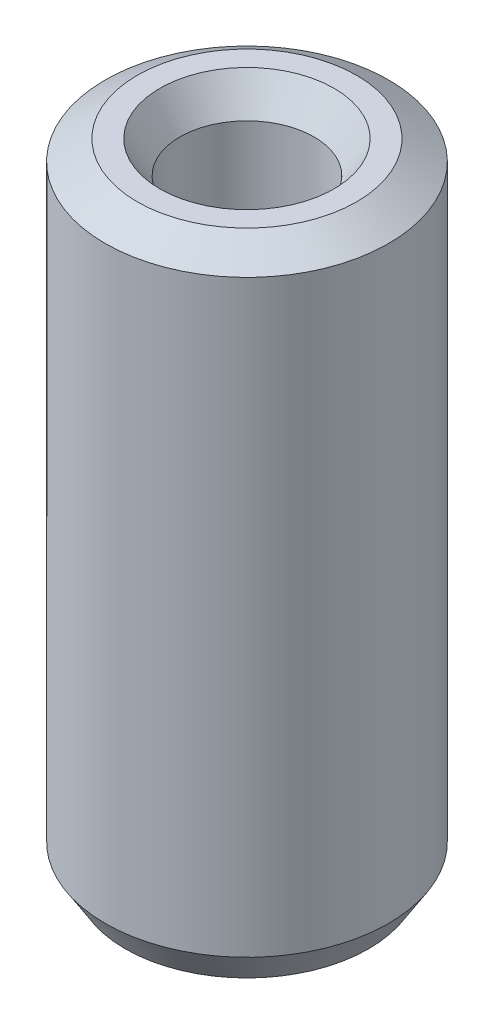
ISO-10303-21;
HEADER;
FILE_DESCRIPTION(('STEP AP214'),'2;1');
FILE_NAME('part.step','',(''),(''),'','','');
FILE_SCHEMA(('AUTOMOTIVE_DESIGN { 1 0 10303 214 1 1 1 1 }'));
ENDSEC;
DATA;
#1=APPLICATION_CONTEXT('core data for automotive mechanical design processes');
#2=APPLICATION_PROTOCOL_DEFINITION('international standard','automotive_design',2000,#1);
#3=PRODUCT_CONTEXT('',#1,'mechanical');
#4=PRODUCT('Part','Part','',(#3));
#5=PRODUCT_RELATED_PRODUCT_CATEGORY('part','',(#4));
#6=PRODUCT_DEFINITION_FORMATION('','',#4);
#7=PRODUCT_DEFINITION_CONTEXT('part definition',#1,'design');
#8=PRODUCT_DEFINITION('design','',#6,#7);
#9=PRODUCT_DEFINITION_SHAPE('','',#8);
#10=(LENGTH_UNIT() NAMED_UNIT(*) SI_UNIT(.MILLI.,.METRE.));
#11=(NAMED_UNIT(*) PLANE_ANGLE_UNIT() SI_UNIT($,.RADIAN.));
#12=(NAMED_UNIT(*) SI_UNIT($,.STERADIAN.) SOLID_ANGLE_UNIT());
#13=UNCERTAINTY_MEASURE_WITH_UNIT(LENGTH_MEASURE(1.E-05),#10,'distance_accuracy_value','');
#14=(GEOMETRIC_REPRESENTATION_CONTEXT(3) GLOBAL_UNCERTAINTY_ASSIGNED_CONTEXT((#13)) GLOBAL_UNIT_ASSIGNED_CONTEXT((#10,
#11,#12)) REPRESENTATION_CONTEXT('',''));
#15=CARTESIAN_POINT('',(0.,0.,0.));
#16=DIRECTION('',(0.,0.,1.));
#17=DIRECTION('',(1.,0.,0.));
#18=AXIS2_PLACEMENT_3D('',#15,#16,#17);
#19=CARTESIAN_POINT('',(0.,33.9199743696865,0.));
#20=DIRECTION('',(0.,-1.,0.));
#21=DIRECTION('',(0.,0.,-1.));
#22=AXIS2_PLACEMENT_3D('',#19,#20,#21);
#23=CYLINDRICAL_SURFACE('',#22,7.5);
#24=CARTESIAN_POINT('',(0.,1.69656926600727,0.));
#25=DIRECTION('',(0.,1.,0.));
#26=DIRECTION('',(0.,0.,1.));
#27=AXIS2_PLACEMENT_3D('',#24,#25,#26);
#28=CIRCLE('',#27,7.5);
#29=CARTESIAN_POINT('',(0.,1.69656926600727,7.5));
#30=VERTEX_POINT('',#29);
#31=EDGE_CURVE('E10',#30,#30,#28,.T.);
#32=ORIENTED_EDGE('',*,*,#31,.T.);
#33=EDGE_LOOP('',(#32));
#34=FACE_BOUND('',#33,.T.);
#35=CARTESIAN_POINT('',(0.,32.8597413938657,0.));
#36=DIRECTION('',(0.,1.,0.));
#37=DIRECTION('',(0.,0.,1.));
#38=AXIS2_PLACEMENT_3D('',#35,#36,#37);
#39=CIRCLE('',#38,7.5);
#40=CARTESIAN_POINT('',(0.,32.8597413938657,7.5));
#41=VERTEX_POINT('',#40);
#42=EDGE_CURVE('E50',#41,#41,#39,.F.);
#43=ORIENTED_EDGE('',*,*,#42,.T.);
#44=EDGE_LOOP('',(#43));
#45=FACE_BOUND('',#44,.T.);
#46=ADVANCED_FACE('F39',(#34,#45),#23,.T.);
#47=CARTESIAN_POINT('',(0.,33.9199743696865,0.));
#48=DIRECTION('',(0.,1.,0.));
#49=DIRECTION('',(0.,0.,1.));
#50=AXIS2_PLACEMENT_3D('',#47,#48,#49);
#51=PLANE('',#50);
#52=CARTESIAN_POINT('',(0.,33.9199743696865,0.));
#53=DIRECTION('',(0.,1.,0.));
#54=DIRECTION('',(0.,0.,1.));
#55=AXIS2_PLACEMENT_3D('',#52,#53,#54);
#56=CIRCLE('',#55,4.61086826307113);
#57=CARTESIAN_POINT('',(0.,33.9199743696865,4.61086826307113));
#58=VERTEX_POINT('',#57);
#59=EDGE_CURVE('E58',#58,#58,#56,.F.);
#60=ORIENTED_EDGE('',*,*,#59,.T.);
#61=EDGE_LOOP('',(#60));
#62=FACE_BOUND('',#61,.T.);
#63=CARTESIAN_POINT('',(0.,33.9199743696865,0.));
#64=DIRECTION('',(0.,1.,0.));
#65=DIRECTION('',(0.,0.,1.));
#66=AXIS2_PLACEMENT_3D('',#63,#64,#65);
#67=CIRCLE('',#66,5.80343073399274);
#68=CARTESIAN_POINT('',(0.,33.9199743696865,5.80343073399274));
#69=VERTEX_POINT('',#68);
#70=EDGE_CURVE('E61',#69,#69,#67,.T.);
#71=ORIENTED_EDGE('',*,*,#70,.T.);
#72=EDGE_LOOP('',(#71));
#73=FACE_BOUND('',#72,.T.);
#74=ADVANCED_FACE('F88',(#62,#73),#51,.T.);
#75=CARTESIAN_POINT('',(0.,0.,0.));
#76=DIRECTION('',(0.,1.,0.));
#77=DIRECTION('',(0.,0.,1.));
#78=AXIS2_PLACEMENT_3D('',#75,#76,#77);
#79=PLANE('',#78);
#80=CARTESIAN_POINT('',(0.,0.,0.));
#81=DIRECTION('',(0.,1.,0.));
#82=DIRECTION('',(0.,0.,1.));
#83=AXIS2_PLACEMENT_3D('',#80,#81,#82);
#84=CIRCLE('',#83,5.24720455325755);
#85=CARTESIAN_POINT('',(0.,0.,5.24720455325755));
#86=VERTEX_POINT('',#85);
#87=EDGE_CURVE('E51',#86,#86,#84,.T.);
#88=ORIENTED_EDGE('',*,*,#87,.T.);
#89=EDGE_LOOP('',(#88));
#90=FACE_BOUND('',#89,.T.);
#91=CARTESIAN_POINT('',(0.,0.,0.));
#92=DIRECTION('',(0.,1.,0.));
#93=DIRECTION('',(0.,0.,1.));
#94=AXIS2_PLACEMENT_3D('',#91,#92,#93);
#95=CIRCLE('',#94,6.43976702417914);
#96=CARTESIAN_POINT('',(0.,0.,6.43976702417914));
#97=VERTEX_POINT('',#96);
#98=EDGE_CURVE('E54',#97,#97,#95,.F.);
#99=ORIENTED_EDGE('',*,*,#98,.T.);
#100=EDGE_LOOP('',(#99));
#101=FACE_BOUND('',#100,.T.);
#102=ADVANCED_FACE('F83',(#90,#101),#79,.F.);
#103=CARTESIAN_POINT('',(0.,33.9199743696865,0.));
#104=DIRECTION('',(0.,-1.,0.));
#105=DIRECTION('',(0.,0.,-1.));
#106=AXIS2_PLACEMENT_3D('',#103,#104,#105);
#107=CYLINDRICAL_SURFACE('',#106,3.55063528725028);
#108=CARTESIAN_POINT('',(0.,32.2234051036793,0.));
#109=DIRECTION('',(0.,1.,0.));
#110=DIRECTION('',(0.,0.,1.));
#111=AXIS2_PLACEMENT_3D('',#108,#109,#110);
#112=CIRCLE('',#111,3.55063528725028);
#113=CARTESIAN_POINT('',(0.,32.2234051036793,3.55063528725028));
#114=VERTEX_POINT('',#113);
#115=EDGE_CURVE('E67',#114,#114,#112,.T.);
#116=ORIENTED_EDGE('',*,*,#115,.T.);
#117=EDGE_LOOP('',(#116));
#118=FACE_BOUND('',#117,.T.);
#119=CARTESIAN_POINT('',(0.,1.06023297582086,0.));
#120=DIRECTION('',(0.,1.,0.));
#121=DIRECTION('',(0.,0.,1.));
#122=AXIS2_PLACEMENT_3D('',#119,#120,#121);
#123=CIRCLE('',#122,3.55063528725028);
#124=CARTESIAN_POINT('',(0.,1.06023297582086,3.55063528725028));
#125=VERTEX_POINT('',#124);
#126=EDGE_CURVE('E69',#125,#125,#123,.F.);
#127=ORIENTED_EDGE('',*,*,#126,.T.);
#128=EDGE_LOOP('',(#127));
#129=FACE_BOUND('',#128,.T.);
#130=ADVANCED_FACE('F71',(#118,#129),#107,.F.);
#131=CARTESIAN_POINT('',(0.,32.2234051036793,0.));
#132=DIRECTION('',(0.,1.,0.));
#133=DIRECTION('',(0.,0.,1.));
#134=AXIS2_PLACEMENT_3D('',#131,#132,#133);
#135=CONICAL_SURFACE('',#134,3.55063528725028,0.558547257587051);
#136=ORIENTED_EDGE('',*,*,#59,.F.);
#137=EDGE_LOOP('',(#136));
#138=FACE_BOUND('',#137,.T.);
#139=ORIENTED_EDGE('',*,*,#115,.F.);
#140=EDGE_LOOP('',(#139));
#141=FACE_BOUND('',#140,.T.);
#142=ADVANCED_FACE('F77',(#138,#141),#135,.F.);
#143=CARTESIAN_POINT('',(0.,0.,0.));
#144=DIRECTION('',(0.,-1.,0.));
#145=DIRECTION('',(0.,0.,-1.));
#146=AXIS2_PLACEMENT_3D('',#143,#144,#145);
#147=CONICAL_SURFACE('',#146,5.24720455325755,1.01224906920785);
#148=ORIENTED_EDGE('',*,*,#126,.F.);
#149=EDGE_LOOP('',(#148));
#150=FACE_BOUND('',#149,.T.);
#151=ORIENTED_EDGE('',*,*,#87,.F.);
#152=EDGE_LOOP('',(#151));
#153=FACE_BOUND('',#152,.T.);
#154=ADVANCED_FACE('F73',(#150,#153),#147,.F.);
#155=CARTESIAN_POINT('',(0.,1.69656926600727,0.));
#156=DIRECTION('',(0.,1.,0.));
#157=DIRECTION('',(0.,0.,1.));
#158=AXIS2_PLACEMENT_3D('',#155,#156,#157);
#159=CONICAL_SURFACE('',#158,7.5,0.558547257587047);
#160=ORIENTED_EDGE('',*,*,#98,.F.);
#161=EDGE_LOOP('',(#160));
#162=FACE_BOUND('',#161,.T.);
#163=ORIENTED_EDGE('',*,*,#31,.F.);
#164=EDGE_LOOP('',(#163));
#165=FACE_BOUND('',#164,.T.);
#166=ADVANCED_FACE('F76',(#162,#165),#159,.T.);
#167=CARTESIAN_POINT('',(0.,33.9199743696865,0.));
#168=DIRECTION('',(0.,-1.,0.));
#169=DIRECTION('',(0.,0.,-1.));
#170=AXIS2_PLACEMENT_3D('',#167,#168,#169);
#171=CONICAL_SURFACE('',#170,5.80343073399274,1.01224906920785);
#172=ORIENTED_EDGE('',*,*,#42,.F.);
#173=EDGE_LOOP('',(#172));
#174=FACE_BOUND('',#173,.T.);
#175=ORIENTED_EDGE('',*,*,#70,.F.);
#176=EDGE_LOOP('',(#175));
#177=FACE_BOUND('',#176,.T.);
#178=ADVANCED_FACE('F45',(#174,#177),#171,.T.);
#179=CLOSED_SHELL('',(#46,#74,#102,#130,#142,#154,#166,#178));
#180=MANIFOLD_SOLID_BREP('B2',#179);
#181=ADVANCED_BREP_SHAPE_REPRESENTATION('',(#18,#180),#14);
#182=SHAPE_DEFINITION_REPRESENTATION(#9,#181);
ENDSEC;
END-ISO-10303-21;
